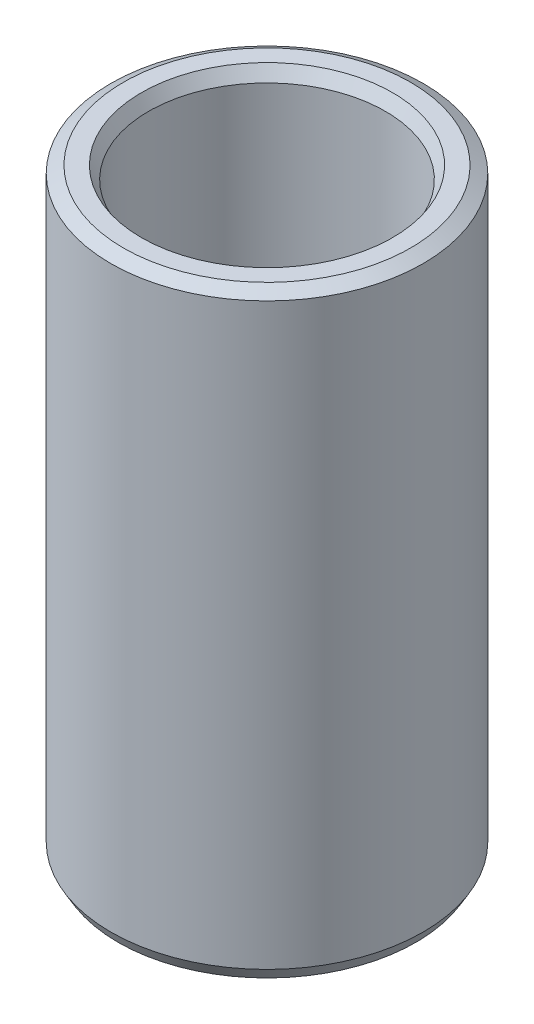
ISO-10303-21;
HEADER;
FILE_DESCRIPTION(('STEP AP214'),'2;1');
FILE_NAME('part.step','',(''),(''),'','','');
FILE_SCHEMA(('AUTOMOTIVE_DESIGN { 1 0 10303 214 1 1 1 1 }'));
ENDSEC;
DATA;
#1=APPLICATION_CONTEXT('core data for automotive mechanical design processes');
#2=APPLICATION_PROTOCOL_DEFINITION('international standard','automotive_design',2000,#1);
#3=PRODUCT_CONTEXT('',#1,'mechanical');
#4=PRODUCT('Part','Part','',(#3));
#5=PRODUCT_RELATED_PRODUCT_CATEGORY('part','',(#4));
#6=PRODUCT_DEFINITION_FORMATION('','',#4);
#7=PRODUCT_DEFINITION_CONTEXT('part definition',#1,'design');
#8=PRODUCT_DEFINITION('design','',#6,#7);
#9=PRODUCT_DEFINITION_SHAPE('','',#8);
#10=(LENGTH_UNIT() NAMED_UNIT(*) SI_UNIT(.MILLI.,.METRE.));
#11=(NAMED_UNIT(*) PLANE_ANGLE_UNIT() SI_UNIT($,.RADIAN.));
#12=(NAMED_UNIT(*) SI_UNIT($,.STERADIAN.) SOLID_ANGLE_UNIT());
#13=UNCERTAINTY_MEASURE_WITH_UNIT(LENGTH_MEASURE(1.E-05),#10,'distance_accuracy_value','');
#14=(GEOMETRIC_REPRESENTATION_CONTEXT(3) GLOBAL_UNCERTAINTY_ASSIGNED_CONTEXT((#13)) GLOBAL_UNIT_ASSIGNED_CONTEXT((#10,
#11,#12)) REPRESENTATION_CONTEXT('',''));
#15=CARTESIAN_POINT('',(0.,0.,0.));
#16=DIRECTION('',(0.,0.,1.));
#17=DIRECTION('',(1.,0.,0.));
#18=AXIS2_PLACEMENT_3D('',#15,#16,#17);
#19=CARTESIAN_POINT('',(0.,47.9325706153126,0.));
#20=DIRECTION('',(0.,-1.,0.));
#21=DIRECTION('',(0.,0.,-1.));
#22=AXIS2_PLACEMENT_3D('',#19,#20,#21);
#23=CYLINDRICAL_SURFACE('',#22,12.5);
#24=CARTESIAN_POINT('',(0.,1.00298601628368,0.));
#25=DIRECTION('',(0.,1.,0.));
#26=DIRECTION('',(0.,0.,1.));
#27=AXIS2_PLACEMENT_3D('',#24,#25,#26);
#28=CIRCLE('',#27,12.5);
#29=CARTESIAN_POINT('',(0.,1.00298601628368,12.5));
#30=VERTEX_POINT('',#29);
#31=EDGE_CURVE('E10',#30,#30,#28,.T.);
#32=ORIENTED_EDGE('',*,*,#31,.T.);
#33=EDGE_LOOP('',(#32));
#34=FACE_BOUND('',#33,.T.);
#35=CARTESIAN_POINT('',(0.,47.3534963688177,0.));
#36=DIRECTION('',(0.,1.,0.));
#37=DIRECTION('',(0.,0.,1.));
#38=AXIS2_PLACEMENT_3D('',#35,#36,#37);
#39=CIRCLE('',#38,12.5);
#40=CARTESIAN_POINT('',(0.,47.3534963688177,12.5));
#41=VERTEX_POINT('',#40);
#42=EDGE_CURVE('E50',#41,#41,#39,.F.);
#43=ORIENTED_EDGE('',*,*,#42,.T.);
#44=EDGE_LOOP('',(#43));
#45=FACE_BOUND('',#44,.T.);
#46=ADVANCED_FACE('F39',(#34,#45),#23,.T.);
#47=CARTESIAN_POINT('',(0.,47.9325706153126,0.));
#48=DIRECTION('',(0.,1.,0.));
#49=DIRECTION('',(0.,0.,1.));
#50=AXIS2_PLACEMENT_3D('',#47,#48,#49);
#51=PLANE('',#50);
#52=CARTESIAN_POINT('',(0.,47.9325706153126,0.));
#53=DIRECTION('',(0.,1.,0.));
#54=DIRECTION('',(0.,0.,1.));
#55=AXIS2_PLACEMENT_3D('',#52,#53,#54);
#56=CIRCLE('',#55,10.05673353625);
#57=CARTESIAN_POINT('',(0.,47.9325706153126,10.05673353625));
#58=VERTEX_POINT('',#57);
#59=EDGE_CURVE('E58',#58,#58,#56,.F.);
#60=ORIENTED_EDGE('',*,*,#59,.T.);
#61=EDGE_LOOP('',(#60));
#62=FACE_BOUND('',#61,.T.);
#63=CARTESIAN_POINT('',(0.,47.9325706153126,0.));
#64=DIRECTION('',(0.,1.,0.));
#65=DIRECTION('',(0.,0.,1.));
#66=AXIS2_PLACEMENT_3D('',#63,#64,#65);
#67=CIRCLE('',#66,11.4970139837163);
#68=CARTESIAN_POINT('',(0.,47.9325706153126,11.4970139837163));
#69=VERTEX_POINT('',#68);
#70=EDGE_CURVE('E61',#69,#69,#67,.T.);
#71=ORIENTED_EDGE('',*,*,#70,.T.);
#72=EDGE_LOOP('',(#71));
#73=FACE_BOUND('',#72,.T.);
#74=ADVANCED_FACE('F88',(#62,#73),#51,.T.);
#75=CARTESIAN_POINT('',(0.,0.,0.));
#76=DIRECTION('',(0.,1.,0.));
#77=DIRECTION('',(0.,0.,1.));
#78=AXIS2_PLACEMENT_3D('',#75,#76,#77);
#79=PLANE('',#78);
#80=CARTESIAN_POINT('',(0.,0.,0.));
#81=DIRECTION('',(0.,1.,0.));
#82=DIRECTION('',(0.,0.,1.));
#83=AXIS2_PLACEMENT_3D('',#80,#81,#82);
#84=CIRCLE('',#83,10.4806453060388);
#85=CARTESIAN_POINT('',(0.,0.,10.4806453060388));
#86=VERTEX_POINT('',#85);
#87=EDGE_CURVE('E51',#86,#86,#84,.T.);
#88=ORIENTED_EDGE('',*,*,#87,.T.);
#89=EDGE_LOOP('',(#88));
#90=FACE_BOUND('',#89,.T.);
#91=CARTESIAN_POINT('',(0.,0.,0.));
#92=DIRECTION('',(0.,1.,0.));
#93=DIRECTION('',(0.,0.,1.));
#94=AXIS2_PLACEMENT_3D('',#91,#92,#93);
#95=CIRCLE('',#94,11.9209257535052);
#96=CARTESIAN_POINT('',(0.,0.,11.9209257535052));
#97=VERTEX_POINT('',#96);
#98=EDGE_CURVE('E54',#97,#97,#95,.F.);
#99=ORIENTED_EDGE('',*,*,#98,.T.);
#100=EDGE_LOOP('',(#99));
#101=FACE_BOUND('',#100,.T.);
#102=ADVANCED_FACE('F83',(#90,#101),#79,.F.);
#103=CARTESIAN_POINT('',(0.,47.9325706153126,0.));
#104=DIRECTION('',(0.,-1.,0.));
#105=DIRECTION('',(0.,0.,-1.));
#106=AXIS2_PLACEMENT_3D('',#103,#104,#105);
#107=CYLINDRICAL_SURFACE('',#106,9.47765928975515);
#108=CARTESIAN_POINT('',(0.,46.9295845990288,0.));
#109=DIRECTION('',(0.,1.,0.));
#110=DIRECTION('',(0.,0.,1.));
#111=AXIS2_PLACEMENT_3D('',#108,#109,#110);
#112=CIRCLE('',#111,9.47765928975515);
#113=CARTESIAN_POINT('',(0.,46.9295845990288,9.47765928975515));
#114=VERTEX_POINT('',#113);
#115=EDGE_CURVE('E67',#114,#114,#112,.T.);
#116=ORIENTED_EDGE('',*,*,#115,.T.);
#117=EDGE_LOOP('',(#116));
#118=FACE_BOUND('',#117,.T.);
#119=CARTESIAN_POINT('',(0.,0.579074246494823,0.));
#120=DIRECTION('',(0.,1.,0.));
#121=DIRECTION('',(0.,0.,1.));
#122=AXIS2_PLACEMENT_3D('',#119,#120,#121);
#123=CIRCLE('',#122,9.47765928975515);
#124=CARTESIAN_POINT('',(0.,0.579074246494823,9.47765928975515));
#125=VERTEX_POINT('',#124);
#126=EDGE_CURVE('E69',#125,#125,#123,.F.);
#127=ORIENTED_EDGE('',*,*,#126,.T.);
#128=EDGE_LOOP('',(#127));
#129=FACE_BOUND('',#128,.T.);
#130=ADVANCED_FACE('F71',(#118,#129),#107,.F.);
#131=CARTESIAN_POINT('',(0.,46.9295845990288,0.));
#132=DIRECTION('',(0.,1.,0.));
#133=DIRECTION('',(0.,0.,1.));
#134=AXIS2_PLACEMENT_3D('',#131,#132,#133);
#135=CONICAL_SURFACE('',#134,9.47765928975515,0.523598775598296);
#136=ORIENTED_EDGE('',*,*,#59,.F.);
#137=EDGE_LOOP('',(#136));
#138=FACE_BOUND('',#137,.T.);
#139=ORIENTED_EDGE('',*,*,#115,.F.);
#140=EDGE_LOOP('',(#139));
#141=FACE_BOUND('',#140,.T.);
#142=ADVANCED_FACE('F77',(#138,#141),#135,.F.);
#143=CARTESIAN_POINT('',(0.,0.,0.));
#144=DIRECTION('',(0.,-1.,0.));
#145=DIRECTION('',(0.,0.,-1.));
#146=AXIS2_PLACEMENT_3D('',#143,#144,#145);
#147=CONICAL_SURFACE('',#146,10.4806453060388,1.04719755119659);
#148=ORIENTED_EDGE('',*,*,#126,.F.);
#149=EDGE_LOOP('',(#148));
#150=FACE_BOUND('',#149,.T.);
#151=ORIENTED_EDGE('',*,*,#87,.F.);
#152=EDGE_LOOP('',(#151));
#153=FACE_BOUND('',#152,.T.);
#154=ADVANCED_FACE('F73',(#150,#153),#147,.F.);
#155=CARTESIAN_POINT('',(0.,1.00298601628368,0.));
#156=DIRECTION('',(0.,1.,0.));
#157=DIRECTION('',(0.,0.,1.));
#158=AXIS2_PLACEMENT_3D('',#155,#156,#157);
#159=CONICAL_SURFACE('',#158,12.5,0.523598775598304);
#160=ORIENTED_EDGE('',*,*,#98,.F.);
#161=EDGE_LOOP('',(#160));
#162=FACE_BOUND('',#161,.T.);
#163=ORIENTED_EDGE('',*,*,#31,.F.);
#164=EDGE_LOOP('',(#163));
#165=FACE_BOUND('',#164,.T.);
#166=ADVANCED_FACE('F76',(#162,#165),#159,.T.);
#167=CARTESIAN_POINT('',(0.,47.9325706153126,0.));
#168=DIRECTION('',(0.,-1.,0.));
#169=DIRECTION('',(0.,0.,-1.));
#170=AXIS2_PLACEMENT_3D('',#167,#168,#169);
#171=CONICAL_SURFACE('',#170,11.4970139837163,1.04719755119659);
#172=ORIENTED_EDGE('',*,*,#42,.F.);
#173=EDGE_LOOP('',(#172));
#174=FACE_BOUND('',#173,.T.);
#175=ORIENTED_EDGE('',*,*,#70,.F.);
#176=EDGE_LOOP('',(#175));
#177=FACE_BOUND('',#176,.T.);
#178=ADVANCED_FACE('F45',(#174,#177),#171,.T.);
#179=CLOSED_SHELL('',(#46,#74,#102,#130,#142,#154,#166,#178));
#180=MANIFOLD_SOLID_BREP('B2',#179);
#181=ADVANCED_BREP_SHAPE_REPRESENTATION('',(#18,#180),#14);
#182=SHAPE_DEFINITION_REPRESENTATION(#9,#181);
ENDSEC;
END-ISO-10303-21;
